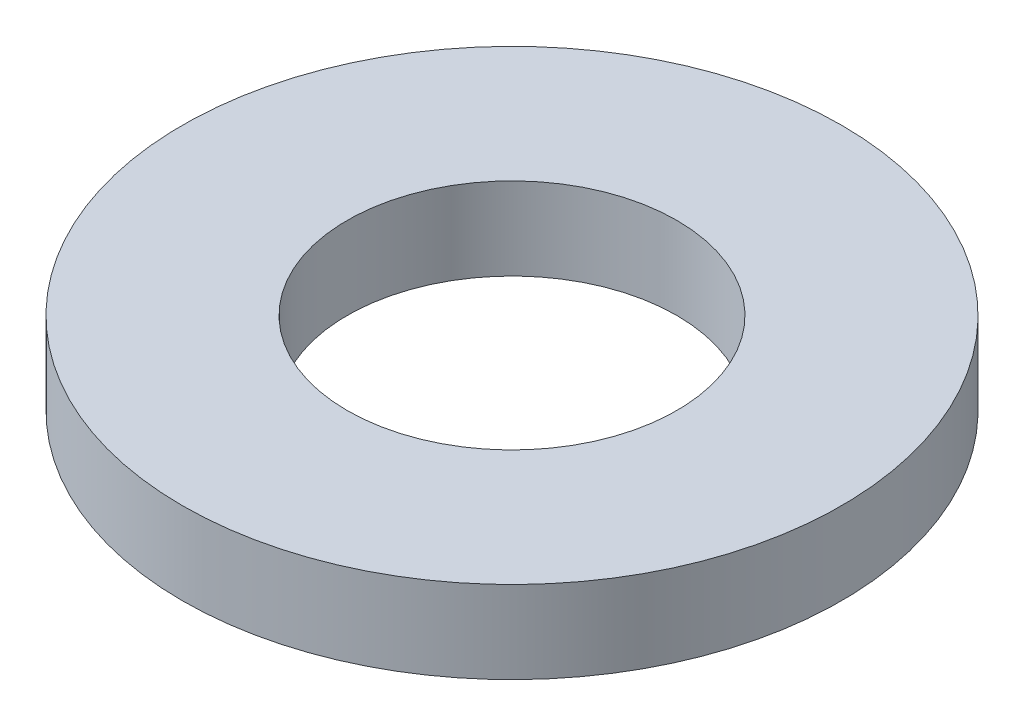
ISO-10303-21;
HEADER;
FILE_DESCRIPTION(('STEP AP214'),'2;1');
FILE_NAME('part.step','',(''),(''),'','','');
FILE_SCHEMA(('AUTOMOTIVE_DESIGN { 1 0 10303 214 1 1 1 1 }'));
ENDSEC;
DATA;
#1=APPLICATION_CONTEXT('core data for automotive mechanical design processes');
#2=APPLICATION_PROTOCOL_DEFINITION('international standard','automotive_design',2000,#1);
#3=PRODUCT_CONTEXT('',#1,'mechanical');
#4=PRODUCT('Part','Part','',(#3));
#5=PRODUCT_RELATED_PRODUCT_CATEGORY('part','',(#4));
#6=PRODUCT_DEFINITION_FORMATION('','',#4);
#7=PRODUCT_DEFINITION_CONTEXT('part definition',#1,'design');
#8=PRODUCT_DEFINITION('design','',#6,#7);
#9=PRODUCT_DEFINITION_SHAPE('','',#8);
#10=(LENGTH_UNIT() NAMED_UNIT(*) SI_UNIT(.MILLI.,.METRE.));
#11=(NAMED_UNIT(*) PLANE_ANGLE_UNIT() SI_UNIT($,.RADIAN.));
#12=(NAMED_UNIT(*) SI_UNIT($,.STERADIAN.) SOLID_ANGLE_UNIT());
#13=UNCERTAINTY_MEASURE_WITH_UNIT(LENGTH_MEASURE(1.E-05),#10,'distance_accuracy_value','');
#14=(GEOMETRIC_REPRESENTATION_CONTEXT(3) GLOBAL_UNCERTAINTY_ASSIGNED_CONTEXT((#13)) GLOBAL_UNIT_ASSIGNED_CONTEXT((#10,
#11,#12)) REPRESENTATION_CONTEXT('',''));
#15=CARTESIAN_POINT('',(0.,0.,0.));
#16=DIRECTION('',(0.,0.,1.));
#17=DIRECTION('',(1.,0.,0.));
#18=AXIS2_PLACEMENT_3D('',#15,#16,#17);
#19=CARTESIAN_POINT('',(0.,1.5,0.));
#20=DIRECTION('',(0.,1.,0.));
#21=DIRECTION('',(0.,0.,1.));
#22=AXIS2_PLACEMENT_3D('',#19,#20,#21);
#23=PLANE('',#22);
#24=CARTESIAN_POINT('',(0.,1.5,0.));
#25=DIRECTION('',(0.,1.,0.));
#26=DIRECTION('',(0.,0.,1.));
#27=AXIS2_PLACEMENT_3D('',#24,#25,#26);
#28=CIRCLE('',#27,6.);
#29=CARTESIAN_POINT('',(0.,1.5,6.));
#30=VERTEX_POINT('',#29);
#31=EDGE_CURVE('E10',#30,#30,#28,.T.);
#32=ORIENTED_EDGE('',*,*,#31,.T.);
#33=EDGE_LOOP('',(#32));
#34=FACE_BOUND('',#33,.T.);
#35=CARTESIAN_POINT('',(0.,1.5,0.));
#36=DIRECTION('',(0.,1.,0.));
#37=DIRECTION('',(0.,0.,1.));
#38=AXIS2_PLACEMENT_3D('',#35,#36,#37);
#39=CIRCLE('',#38,3.);
#40=CARTESIAN_POINT('',(0.,1.5,3.));
#41=VERTEX_POINT('',#40);
#42=EDGE_CURVE('E45',#41,#41,#39,.T.);
#43=ORIENTED_EDGE('',*,*,#42,.F.);
#44=EDGE_LOOP('',(#43));
#45=FACE_BOUND('',#44,.T.);
#46=ADVANCED_FACE('F34',(#34,#45),#23,.T.);
#47=CARTESIAN_POINT('',(0.,0.,0.));
#48=DIRECTION('',(0.,1.,0.));
#49=DIRECTION('',(0.,0.,1.));
#50=AXIS2_PLACEMENT_3D('',#47,#48,#49);
#51=PLANE('',#50);
#52=CARTESIAN_POINT('',(0.,0.,0.));
#53=DIRECTION('',(0.,1.,0.));
#54=DIRECTION('',(0.,0.,1.));
#55=AXIS2_PLACEMENT_3D('',#52,#53,#54);
#56=CIRCLE('',#55,6.);
#57=CARTESIAN_POINT('',(0.,0.,6.));
#58=VERTEX_POINT('',#57);
#59=EDGE_CURVE('E38',#58,#58,#56,.T.);
#60=ORIENTED_EDGE('',*,*,#59,.F.);
#61=EDGE_LOOP('',(#60));
#62=FACE_BOUND('',#61,.T.);
#63=CARTESIAN_POINT('',(0.,0.,0.));
#64=DIRECTION('',(0.,1.,0.));
#65=DIRECTION('',(0.,0.,1.));
#66=AXIS2_PLACEMENT_3D('',#63,#64,#65);
#67=CIRCLE('',#66,3.);
#68=CARTESIAN_POINT('',(0.,0.,3.));
#69=VERTEX_POINT('',#68);
#70=EDGE_CURVE('E47',#69,#69,#67,.T.);
#71=ORIENTED_EDGE('',*,*,#70,.T.);
#72=EDGE_LOOP('',(#71));
#73=FACE_BOUND('',#72,.T.);
#74=ADVANCED_FACE('F57',(#62,#73),#51,.F.);
#75=CARTESIAN_POINT('',(0.,1.5,0.));
#76=DIRECTION('',(0.,-1.,0.));
#77=DIRECTION('',(0.,0.,-1.));
#78=AXIS2_PLACEMENT_3D('',#75,#76,#77);
#79=CYLINDRICAL_SURFACE('',#78,6.);
#80=ORIENTED_EDGE('',*,*,#31,.F.);
#81=EDGE_LOOP('',(#80));
#82=FACE_BOUND('',#81,.T.);
#83=ORIENTED_EDGE('',*,*,#59,.T.);
#84=EDGE_LOOP('',(#83));
#85=FACE_BOUND('',#84,.T.);
#86=ADVANCED_FACE('F36',(#82,#85),#79,.T.);
#87=CARTESIAN_POINT('',(0.,1.5,0.));
#88=DIRECTION('',(0.,-1.,0.));
#89=DIRECTION('',(0.,0.,-1.));
#90=AXIS2_PLACEMENT_3D('',#87,#88,#89);
#91=CYLINDRICAL_SURFACE('',#90,3.);
#92=ORIENTED_EDGE('',*,*,#42,.T.);
#93=EDGE_LOOP('',(#92));
#94=FACE_BOUND('',#93,.T.);
#95=ORIENTED_EDGE('',*,*,#70,.F.);
#96=EDGE_LOOP('',(#95));
#97=FACE_BOUND('',#96,.T.);
#98=ADVANCED_FACE('F53',(#94,#97),#91,.F.);
#99=CLOSED_SHELL('',(#46,#74,#86,#98));
#100=MANIFOLD_SOLID_BREP('B2',#99);
#101=ADVANCED_BREP_SHAPE_REPRESENTATION('',(#18,#100),#14);
#102=SHAPE_DEFINITION_REPRESENTATION(#9,#101);
ENDSEC;
END-ISO-10303-21;
